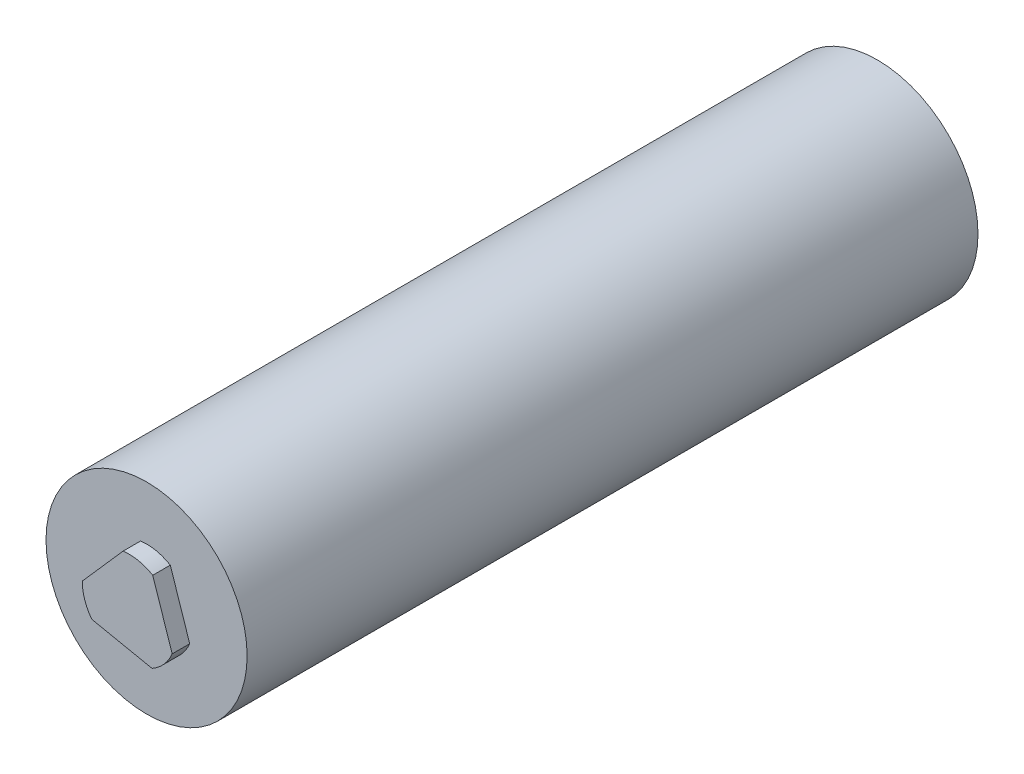
ISO-10303-21;
HEADER;
FILE_DESCRIPTION(('STEP AP214'),'2;1');
FILE_NAME('part.step','',(''),(''),'','','');
FILE_SCHEMA(('AUTOMOTIVE_DESIGN { 1 0 10303 214 1 1 1 1 }'));
ENDSEC;
DATA;
#1=APPLICATION_CONTEXT('core data for automotive mechanical design processes');
#2=APPLICATION_PROTOCOL_DEFINITION('international standard','automotive_design',2000,#1);
#3=PRODUCT_CONTEXT('',#1,'mechanical');
#4=PRODUCT('Part','Part','',(#3));
#5=PRODUCT_RELATED_PRODUCT_CATEGORY('part','',(#4));
#6=PRODUCT_DEFINITION_FORMATION('','',#4);
#7=PRODUCT_DEFINITION_CONTEXT('part definition',#1,'design');
#8=PRODUCT_DEFINITION('design','',#6,#7);
#9=PRODUCT_DEFINITION_SHAPE('','',#8);
#10=(LENGTH_UNIT() NAMED_UNIT(*) SI_UNIT(.MILLI.,.METRE.));
#11=(NAMED_UNIT(*) PLANE_ANGLE_UNIT() SI_UNIT($,.RADIAN.));
#12=(NAMED_UNIT(*) SI_UNIT($,.STERADIAN.) SOLID_ANGLE_UNIT());
#13=UNCERTAINTY_MEASURE_WITH_UNIT(LENGTH_MEASURE(1.E-05),#10,'distance_accuracy_value','');
#14=(GEOMETRIC_REPRESENTATION_CONTEXT(3) GLOBAL_UNCERTAINTY_ASSIGNED_CONTEXT((#13)) GLOBAL_UNIT_ASSIGNED_CONTEXT((#10,
#11,#12)) REPRESENTATION_CONTEXT('',''));
#15=CARTESIAN_POINT('',(0.,0.,0.));
#16=DIRECTION('',(0.,0.,1.));
#17=DIRECTION('',(1.,0.,0.));
#18=AXIS2_PLACEMENT_3D('',#15,#16,#17);
#19=CARTESIAN_POINT('',(0.,0.,64.));
#20=DIRECTION('',(0.,0.,-1.));
#21=DIRECTION('',(-1.,0.,0.));
#22=AXIS2_PLACEMENT_3D('',#19,#20,#21);
#23=CYLINDRICAL_SURFACE('',#22,8.6);
#24=CARTESIAN_POINT('',(0.,0.,0.));
#25=DIRECTION('',(0.,0.,1.));
#26=DIRECTION('',(1.,0.,0.));
#27=AXIS2_PLACEMENT_3D('',#24,#25,#26);
#28=CIRCLE('',#27,8.6);
#29=CARTESIAN_POINT('',(8.6,0.,0.));
#30=VERTEX_POINT('',#29);
#31=EDGE_CURVE('E12',#30,#30,#28,.T.);
#32=ORIENTED_EDGE('',*,*,#31,.T.);
#33=EDGE_LOOP('',(#32));
#34=FACE_BOUND('',#33,.T.);
#35=CARTESIAN_POINT('',(0.,0.,62.5));
#36=DIRECTION('',(0.,0.,1.));
#37=DIRECTION('',(1.,0.,0.));
#38=AXIS2_PLACEMENT_3D('',#35,#36,#37);
#39=CIRCLE('',#38,8.6);
#40=CARTESIAN_POINT('',(8.6,0.,62.5));
#41=VERTEX_POINT('',#40);
#42=EDGE_CURVE('E40',#41,#41,#39,.T.);
#43=ORIENTED_EDGE('',*,*,#42,.F.);
#44=EDGE_LOOP('',(#43));
#45=FACE_BOUND('',#44,.T.);
#46=ADVANCED_FACE('F37',(#34,#45),#23,.T.);
#47=CARTESIAN_POINT('',(0.,0.,0.));
#48=DIRECTION('',(0.,0.,1.));
#49=DIRECTION('',(1.,0.,0.));
#50=AXIS2_PLACEMENT_3D('',#47,#48,#49);
#51=PLANE('',#50);
#52=ORIENTED_EDGE('',*,*,#31,.F.);
#53=EDGE_LOOP('',(#52));
#54=FACE_BOUND('',#53,.T.);
#55=ADVANCED_FACE('F164',(#54),#51,.F.);
#56=CARTESIAN_POINT('',(0.,0.,62.5));
#57=DIRECTION('',(0.,0.,1.));
#58=DIRECTION('',(1.,0.,0.));
#59=AXIS2_PLACEMENT_3D('',#56,#57,#58);
#60=PLANE('',#59);
#61=DIRECTION('',(-0.315777017893277,0.948833428463832,0.));
#62=VECTOR('',#61,1.);
#63=CARTESIAN_POINT('',(2.02818719596745,3.44767409975388,62.5));
#64=LINE('',#63,#62);
#65=CARTESIAN_POINT('',(3.68968809939245,-1.54473354634438,62.5));
#66=VERTEX_POINT('',#65);
#67=CARTESIAN_POINT('',(2.02818719596745,3.44767409975388,62.5));
#68=VERTEX_POINT('',#67);
#69=EDGE_CURVE('E101',#66,#68,#64,.T.);
#70=ORIENTED_EDGE('',*,*,#69,.F.);
#71=CARTESIAN_POINT('',(0.,0.,62.5));
#72=DIRECTION('',(0.,0.,1.));
#73=DIRECTION('',(-1.,0.,0.));
#74=AXIS2_PLACEMENT_3D('',#71,#72,#73);
#75=CIRCLE('',#74,3.99999999999996);
#76=CARTESIAN_POINT('',(1.97167975637278,-3.48029868521507,62.5));
#77=VERTEX_POINT('',#76);
#78=EDGE_CURVE('E122',#77,#66,#75,.T.);
#79=ORIENTED_EDGE('',*,*,#78,.F.);
#80=DIRECTION('',(0.979602361956201,-0.200945794805045,0.));
#81=VECTOR('',#80,1.);
#82=CARTESIAN_POINT('',(-3.18262254290849,-2.4229968529428,62.5));
#83=LINE('',#82,#81);
#84=CARTESIAN_POINT('',(-3.18262254290849,-2.4229968529428,62.5));
#85=VERTEX_POINT('',#84);
#86=EDGE_CURVE('E119',#85,#77,#83,.T.);
#87=ORIENTED_EDGE('',*,*,#86,.F.);
#88=CARTESIAN_POINT('',(0.,0.,62.5));
#89=DIRECTION('',(0.,0.,1.));
#90=DIRECTION('',(1.,0.,0.));
#91=AXIS2_PLACEMENT_3D('',#88,#89,#90);
#92=CIRCLE('',#91,4.);
#93=CARTESIAN_POINT('',(-4.,0.,62.5));
#94=VERTEX_POINT('',#93);
#95=EDGE_CURVE('E59',#94,#85,#92,.T.);
#96=ORIENTED_EDGE('',*,*,#95,.F.);
#97=DIRECTION('',(-0.66076985814995,-0.75058856543415,0.));
#98=VECTOR('',#97,1.);
#99=CARTESIAN_POINT('',(-0.507065556483964,3.96773039928718,62.5));
#100=LINE('',#99,#98);
#101=CARTESIAN_POINT('',(-0.507065556483964,3.96773039928718,62.5));
#102=VERTEX_POINT('',#101);
#103=EDGE_CURVE('E93',#102,#94,#100,.T.);
#104=ORIENTED_EDGE('',*,*,#103,.F.);
#105=CARTESIAN_POINT('',(0.,0.,62.5));
#106=DIRECTION('',(0.,0.,1.));
#107=DIRECTION('',(-1.,0.,0.));
#108=AXIS2_PLACEMENT_3D('',#105,#106,#107);
#109=CIRCLE('',#108,4.);
#110=EDGE_CURVE('E107',#68,#102,#109,.T.);
#111=ORIENTED_EDGE('',*,*,#110,.F.);
#112=EDGE_LOOP('',(#70,#79,#87,#96,#104,#111));
#113=FACE_BOUND('',#112,.T.);
#114=ORIENTED_EDGE('',*,*,#42,.T.);
#115=EDGE_LOOP('',(#114));
#116=FACE_BOUND('',#115,.T.);
#117=ADVANCED_FACE('F105',(#113,#116),#60,.T.);
#118=CARTESIAN_POINT('',(0.,0.,62.5));
#119=DIRECTION('',(0.,0.,1.));
#120=DIRECTION('',(1.,0.,0.));
#121=AXIS2_PLACEMENT_3D('',#118,#119,#120);
#122=CYLINDRICAL_SURFACE('',#121,4.);
#123=CARTESIAN_POINT('',(0.,0.,64.));
#124=DIRECTION('',(0.,0.,1.));
#125=DIRECTION('',(-1.,0.,0.));
#126=AXIS2_PLACEMENT_3D('',#123,#124,#125);
#127=CIRCLE('',#126,4.);
#128=CARTESIAN_POINT('',(2.02818719596745,3.44767409975388,64.));
#129=VERTEX_POINT('',#128);
#130=CARTESIAN_POINT('',(-0.507065556483964,3.96773039928718,64.));
#131=VERTEX_POINT('',#130);
#132=EDGE_CURVE('E126',#129,#131,#127,.T.);
#133=ORIENTED_EDGE('',*,*,#132,.F.);
#134=DIRECTION('',(0.,0.,1.));
#135=VECTOR('',#134,1.);
#136=CARTESIAN_POINT('',(2.02818719596745,3.44767409975388,62.5));
#137=LINE('',#136,#135);
#138=EDGE_CURVE('E111',#68,#129,#137,.T.);
#139=ORIENTED_EDGE('',*,*,#138,.F.);
#140=ORIENTED_EDGE('',*,*,#110,.T.);
#141=DIRECTION('',(0.,0.,1.));
#142=VECTOR('',#141,1.);
#143=CARTESIAN_POINT('',(-0.507065556483964,3.96773039928718,62.5));
#144=LINE('',#143,#142);
#145=EDGE_CURVE('E91',#102,#131,#144,.T.);
#146=ORIENTED_EDGE('',*,*,#145,.T.);
#147=EDGE_LOOP('',(#133,#139,#140,#146));
#148=FACE_BOUND('',#147,.T.);
#149=ADVANCED_FACE('F110',(#148),#122,.T.);
#150=CARTESIAN_POINT('',(2.02818719596745,3.44767409975388,62.5));
#151=DIRECTION('',(0.948833428463831,0.315777017893277,0.));
#152=DIRECTION('',(-0.315777017893277,0.948833428463832,0.));
#153=AXIS2_PLACEMENT_3D('',#150,#151,#152);
#154=PLANE('',#153);
#155=DIRECTION('',(-0.315777017893277,0.948833428463832,0.));
#156=VECTOR('',#155,1.);
#157=CARTESIAN_POINT('',(2.02818719596745,3.44767409975388,64.));
#158=LINE('',#157,#156);
#159=CARTESIAN_POINT('',(3.68968809939245,-1.54473354634438,64.));
#160=VERTEX_POINT('',#159);
#161=EDGE_CURVE('E112',#160,#129,#158,.T.);
#162=ORIENTED_EDGE('',*,*,#161,.F.);
#163=DIRECTION('',(0.,0.,1.));
#164=VECTOR('',#163,1.);
#165=CARTESIAN_POINT('',(3.68968809939245,-1.54473354634438,62.5));
#166=LINE('',#165,#164);
#167=EDGE_CURVE('E136',#66,#160,#166,.T.);
#168=ORIENTED_EDGE('',*,*,#167,.F.);
#169=ORIENTED_EDGE('',*,*,#69,.T.);
#170=ORIENTED_EDGE('',*,*,#138,.T.);
#171=EDGE_LOOP('',(#162,#168,#169,#170));
#172=FACE_BOUND('',#171,.T.);
#173=ADVANCED_FACE('F147',(#172),#154,.T.);
#174=CARTESIAN_POINT('',(0.,0.,62.5));
#175=DIRECTION('',(0.,0.,1.));
#176=DIRECTION('',(1.,0.,0.));
#177=AXIS2_PLACEMENT_3D('',#174,#175,#176);
#178=CYLINDRICAL_SURFACE('',#177,3.99999999999996);
#179=CARTESIAN_POINT('',(0.,0.,64.));
#180=DIRECTION('',(0.,0.,1.));
#181=DIRECTION('',(-1.,0.,0.));
#182=AXIS2_PLACEMENT_3D('',#179,#180,#181);
#183=CIRCLE('',#182,3.99999999999996);
#184=CARTESIAN_POINT('',(1.97167975637278,-3.48029868521507,64.));
#185=VERTEX_POINT('',#184);
#186=EDGE_CURVE('E115',#185,#160,#183,.T.);
#187=ORIENTED_EDGE('',*,*,#186,.F.);
#188=DIRECTION('',(0.,0.,1.));
#189=VECTOR('',#188,1.);
#190=CARTESIAN_POINT('',(1.97167975637278,-3.48029868521507,62.5));
#191=LINE('',#190,#189);
#192=EDGE_CURVE('E138',#77,#185,#191,.T.);
#193=ORIENTED_EDGE('',*,*,#192,.F.);
#194=ORIENTED_EDGE('',*,*,#78,.T.);
#195=ORIENTED_EDGE('',*,*,#167,.T.);
#196=EDGE_LOOP('',(#187,#193,#194,#195));
#197=FACE_BOUND('',#196,.T.);
#198=ADVANCED_FACE('F150',(#197),#178,.T.);
#199=CARTESIAN_POINT('',(-3.18262254290849,-2.4229968529428,62.5));
#200=DIRECTION('',(-0.200945794805045,-0.979602361956202,0.));
#201=DIRECTION('',(0.979602361956202,-0.200945794805045,0.));
#202=AXIS2_PLACEMENT_3D('',#199,#200,#201);
#203=PLANE('',#202);
#204=DIRECTION('',(0.979602361956201,-0.200945794805045,0.));
#205=VECTOR('',#204,1.);
#206=CARTESIAN_POINT('',(-3.18262254290849,-2.4229968529428,64.));
#207=LINE('',#206,#205);
#208=CARTESIAN_POINT('',(-3.18262254290849,-2.4229968529428,64.));
#209=VERTEX_POINT('',#208);
#210=EDGE_CURVE('E130',#209,#185,#207,.T.);
#211=ORIENTED_EDGE('',*,*,#210,.F.);
#212=DIRECTION('',(0.,0.,1.));
#213=VECTOR('',#212,1.);
#214=CARTESIAN_POINT('',(-3.18262254290849,-2.4229968529428,62.5));
#215=LINE('',#214,#213);
#216=EDGE_CURVE('E140',#85,#209,#215,.T.);
#217=ORIENTED_EDGE('',*,*,#216,.F.);
#218=ORIENTED_EDGE('',*,*,#86,.T.);
#219=ORIENTED_EDGE('',*,*,#192,.T.);
#220=EDGE_LOOP('',(#211,#217,#218,#219));
#221=FACE_BOUND('',#220,.T.);
#222=ADVANCED_FACE('F153',(#221),#203,.T.);
#223=CARTESIAN_POINT('',(0.,0.,62.5));
#224=DIRECTION('',(0.,0.,1.));
#225=DIRECTION('',(1.,0.,0.));
#226=AXIS2_PLACEMENT_3D('',#223,#224,#225);
#227=CYLINDRICAL_SURFACE('',#226,4.);
#228=CARTESIAN_POINT('',(0.,0.,64.));
#229=DIRECTION('',(0.,0.,1.));
#230=DIRECTION('',(1.,0.,0.));
#231=AXIS2_PLACEMENT_3D('',#228,#229,#230);
#232=CIRCLE('',#231,4.);
#233=CARTESIAN_POINT('',(-4.,0.,64.));
#234=VERTEX_POINT('',#233);
#235=EDGE_CURVE('E51',#234,#209,#232,.T.);
#236=ORIENTED_EDGE('',*,*,#235,.F.);
#237=DIRECTION('',(0.,0.,1.));
#238=VECTOR('',#237,1.);
#239=CARTESIAN_POINT('',(-4.,0.,62.5));
#240=LINE('',#239,#238);
#241=EDGE_CURVE('E100',#94,#234,#240,.T.);
#242=ORIENTED_EDGE('',*,*,#241,.F.);
#243=ORIENTED_EDGE('',*,*,#95,.T.);
#244=ORIENTED_EDGE('',*,*,#216,.T.);
#245=EDGE_LOOP('',(#236,#242,#243,#244));
#246=FACE_BOUND('',#245,.T.);
#247=ADVANCED_FACE('F154',(#246),#227,.T.);
#248=CARTESIAN_POINT('',(-0.507065556483964,3.96773039928718,62.5));
#249=DIRECTION('',(-0.75058856543415,0.660769858149949,0.));
#250=DIRECTION('',(-0.66076985814995,-0.75058856543415,0.));
#251=AXIS2_PLACEMENT_3D('',#248,#249,#250);
#252=PLANE('',#251);
#253=DIRECTION('',(-0.66076985814995,-0.75058856543415,0.));
#254=VECTOR('',#253,1.);
#255=CARTESIAN_POINT('',(-0.507065556483964,3.96773039928718,64.));
#256=LINE('',#255,#254);
#257=EDGE_CURVE('E95',#131,#234,#256,.T.);
#258=ORIENTED_EDGE('',*,*,#257,.F.);
#259=ORIENTED_EDGE('',*,*,#145,.F.);
#260=ORIENTED_EDGE('',*,*,#103,.T.);
#261=ORIENTED_EDGE('',*,*,#241,.T.);
#262=EDGE_LOOP('',(#258,#259,#260,#261));
#263=FACE_BOUND('',#262,.T.);
#264=ADVANCED_FACE('F92',(#263),#252,.T.);
#265=CARTESIAN_POINT('',(0.,0.,64.));
#266=DIRECTION('',(0.,0.,1.));
#267=DIRECTION('',(1.,0.,0.));
#268=AXIS2_PLACEMENT_3D('',#265,#266,#267);
#269=PLANE('',#268);
#270=ORIENTED_EDGE('',*,*,#161,.T.);
#271=ORIENTED_EDGE('',*,*,#132,.T.);
#272=ORIENTED_EDGE('',*,*,#257,.T.);
#273=ORIENTED_EDGE('',*,*,#235,.T.);
#274=ORIENTED_EDGE('',*,*,#210,.T.);
#275=ORIENTED_EDGE('',*,*,#186,.T.);
#276=EDGE_LOOP('',(#270,#271,#272,#273,#274,#275));
#277=FACE_BOUND('',#276,.T.);
#278=ADVANCED_FACE('F143',(#277),#269,.T.);
#279=CLOSED_SHELL('',(#46,#55,#117,#149,#173,#198,#222,#247,#264,#278));
#280=MANIFOLD_SOLID_BREP('B2',#279);
#281=ADVANCED_BREP_SHAPE_REPRESENTATION('',(#18,#280),#14);
#282=SHAPE_DEFINITION_REPRESENTATION(#9,#281);
ENDSEC;
END-ISO-10303-21;
